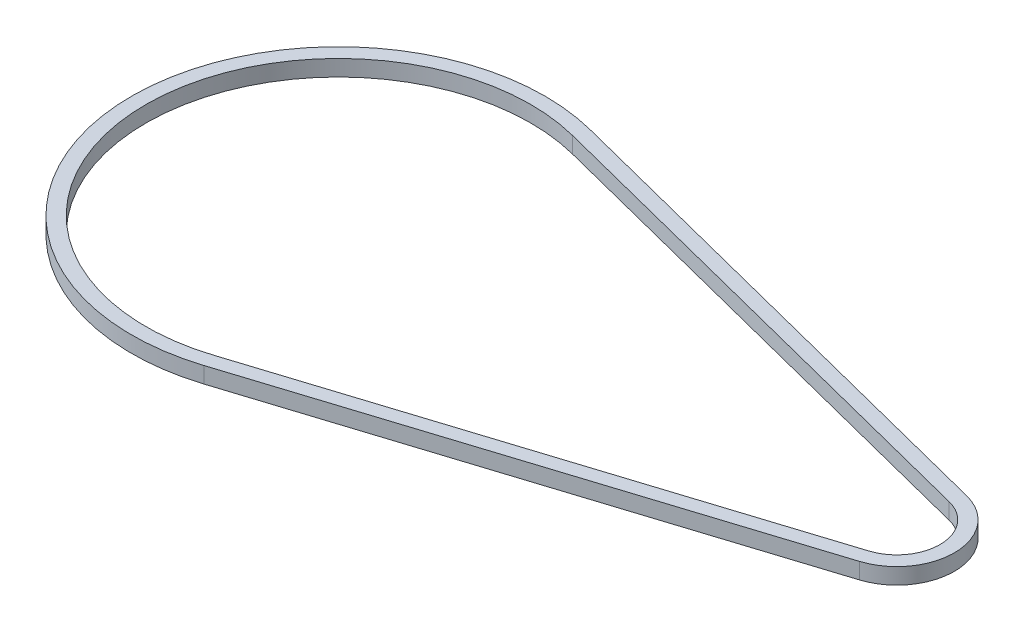
ISO-10303-21;
HEADER;
FILE_DESCRIPTION(('STEP AP214'),'2;1');
FILE_NAME('part.step','',(''),(''),'','','');
FILE_SCHEMA(('AUTOMOTIVE_DESIGN { 1 0 10303 214 1 1 1 1 }'));
ENDSEC;
DATA;
#1=APPLICATION_CONTEXT('core data for automotive mechanical design processes');
#2=APPLICATION_PROTOCOL_DEFINITION('international standard','automotive_design',2000,#1);
#3=PRODUCT_CONTEXT('',#1,'mechanical');
#4=PRODUCT('Part','Part','',(#3));
#5=PRODUCT_RELATED_PRODUCT_CATEGORY('part','',(#4));
#6=PRODUCT_DEFINITION_FORMATION('','',#4);
#7=PRODUCT_DEFINITION_CONTEXT('part definition',#1,'design');
#8=PRODUCT_DEFINITION('design','',#6,#7);
#9=PRODUCT_DEFINITION_SHAPE('','',#8);
#10=(LENGTH_UNIT() NAMED_UNIT(*) SI_UNIT(.MILLI.,.METRE.));
#11=(NAMED_UNIT(*) PLANE_ANGLE_UNIT() SI_UNIT($,.RADIAN.));
#12=(NAMED_UNIT(*) SI_UNIT($,.STERADIAN.) SOLID_ANGLE_UNIT());
#13=UNCERTAINTY_MEASURE_WITH_UNIT(LENGTH_MEASURE(1.E-05),#10,'distance_accuracy_value','');
#14=(GEOMETRIC_REPRESENTATION_CONTEXT(3) GLOBAL_UNCERTAINTY_ASSIGNED_CONTEXT((#13)) GLOBAL_UNIT_ASSIGNED_CONTEXT((#10,
#11,#12)) REPRESENTATION_CONTEXT('',''));
#15=CARTESIAN_POINT('',(0.,0.,0.));
#16=DIRECTION('',(0.,0.,1.));
#17=DIRECTION('',(1.,0.,0.));
#18=AXIS2_PLACEMENT_3D('',#15,#16,#17);
#19=CARTESIAN_POINT('',(-192.756134240439,8.4,3.24206526477096));
#20=DIRECTION('',(0.,1.,0.));
#21=DIRECTION('',(0.,0.,1.));
#22=AXIS2_PLACEMENT_3D('',#19,#20,#21);
#23=PLANE('',#22);
#24=CARTESIAN_POINT('',(-192.756134240439,8.4,3.24206526477096));
#25=DIRECTION('',(0.,1.,0.));
#26=DIRECTION('',(0.,0.,1.));
#27=AXIS2_PLACEMENT_3D('',#24,#25,#26);
#28=CIRCLE('',#27,108.);
#29=CARTESIAN_POINT('',(-166.082554013822,8.4,-101.412223313835));
#30=VERTEX_POINT('',#29);
#31=CARTESIAN_POINT('',(-160.036846225098,8.4,106.166543362885));
#32=VERTEX_POINT('',#31);
#33=EDGE_CURVE('E134',#30,#32,#28,.T.);
#34=ORIENTED_EDGE('',*,*,#33,.T.);
#35=DIRECTION('',(0.953004426834389,0.,-0.302956370512417));
#36=VECTOR('',#35,1.);
#37=CARTESIAN_POINT('',(-160.036846225098,8.4,106.166543362885));
#38=LINE('',#37,#36);
#39=CARTESIAN_POINT('',(99.7625568749338,8.4,23.5773318038965));
#40=VERTEX_POINT('',#39);
#41=EDGE_CURVE('E137',#32,#40,#38,.T.);
#42=ORIENTED_EDGE('',*,*,#41,.T.);
#43=CARTESIAN_POINT('',(90.6738657595612,8.4,-5.01280100113516));
#44=DIRECTION('',(0.,1.,0.));
#45=DIRECTION('',(0.,0.,1.));
#46=AXIS2_PLACEMENT_3D('',#43,#44,#45);
#47=CIRCLE('',#46,30.);
#48=CARTESIAN_POINT('',(98.0831936002882,8.4,-34.0834367174147));
#49=VERTEX_POINT('',#48);
#50=EDGE_CURVE('E140',#40,#49,#47,.T.);
#51=ORIENTED_EDGE('',*,*,#50,.T.);
#52=DIRECTION('',(-0.969021190542652,0.,-0.246977594690898));
#53=VECTOR('',#52,1.);
#54=CARTESIAN_POINT('',(-166.082554013822,8.4,-101.412223313835));
#55=LINE('',#54,#53);
#56=EDGE_CURVE('E142',#49,#30,#55,.T.);
#57=ORIENTED_EDGE('',*,*,#56,.T.);
#58=EDGE_LOOP('',(#34,#42,#51,#57));
#59=FACE_BOUND('',#58,.T.);
#60=DIRECTION('',(0.953004426834389,0.,-0.302956370512417));
#61=VECTOR('',#60,1.);
#62=CARTESIAN_POINT('',(-162.309019003941,8.4,99.0190101616271));
#63=LINE('',#62,#61);
#64=CARTESIAN_POINT('',(-162.309019003941,8.4,99.0190101616271));
#65=VERTEX_POINT('',#64);
#66=CARTESIAN_POINT('',(97.4903840960906,8.4,16.4297986026386));
#67=VERTEX_POINT('',#66);
#68=EDGE_CURVE('E106',#65,#67,#63,.T.);
#69=ORIENTED_EDGE('',*,*,#68,.F.);
#70=CARTESIAN_POINT('',(-192.756134240439,8.4,3.24206526477096));
#71=DIRECTION('',(0.,1.,0.));
#72=DIRECTION('',(0.,0.,1.));
#73=AXIS2_PLACEMENT_3D('',#70,#71,#72);
#74=CIRCLE('',#73,100.5);
#75=CARTESIAN_POINT('',(-167.934885974004,8.4,-94.1445643847655));
#76=VERTEX_POINT('',#75);
#77=EDGE_CURVE('E98',#76,#65,#74,.T.);
#78=ORIENTED_EDGE('',*,*,#77,.F.);
#79=DIRECTION('',(-0.969021190542652,0.,-0.246977594690898));
#80=VECTOR('',#79,1.);
#81=CARTESIAN_POINT('',(-167.934885974004,8.4,-94.1445643847655));
#82=LINE('',#81,#80);
#83=CARTESIAN_POINT('',(96.2308616401064,8.4,-26.8157777883448));
#84=VERTEX_POINT('',#83);
#85=EDGE_CURVE('E120',#84,#76,#82,.T.);
#86=ORIENTED_EDGE('',*,*,#85,.F.);
#87=CARTESIAN_POINT('',(90.6738657595612,8.4,-5.01280100113516));
#88=DIRECTION('',(0.,1.,0.));
#89=DIRECTION('',(0.,0.,1.));
#90=AXIS2_PLACEMENT_3D('',#87,#88,#89);
#91=CIRCLE('',#90,22.5);
#92=EDGE_CURVE('E118',#67,#84,#91,.T.);
#93=ORIENTED_EDGE('',*,*,#92,.F.);
#94=EDGE_LOOP('',(#69,#78,#86,#93));
#95=FACE_BOUND('',#94,.T.);
#96=ADVANCED_FACE('F33',(#59,#95),#23,.T.);
#97=CARTESIAN_POINT('',(-192.756134240439,0.,3.24206526477096));
#98=DIRECTION('',(0.,1.,0.));
#99=DIRECTION('',(0.,0.,1.));
#100=AXIS2_PLACEMENT_3D('',#97,#98,#99);
#101=PLANE('',#100);
#102=CARTESIAN_POINT('',(-192.756134240439,0.,3.24206526477096));
#103=DIRECTION('',(0.,1.,0.));
#104=DIRECTION('',(0.,0.,1.));
#105=AXIS2_PLACEMENT_3D('',#102,#103,#104);
#106=CIRCLE('',#105,108.);
#107=CARTESIAN_POINT('',(-166.082554013822,0.,-101.412223313835));
#108=VERTEX_POINT('',#107);
#109=CARTESIAN_POINT('',(-160.036846225098,0.,106.166543362885));
#110=VERTEX_POINT('',#109);
#111=EDGE_CURVE('E114',#108,#110,#106,.T.);
#112=ORIENTED_EDGE('',*,*,#111,.F.);
#113=DIRECTION('',(-0.969021190542652,0.,-0.246977594690898));
#114=VECTOR('',#113,1.);
#115=CARTESIAN_POINT('',(-166.082554013822,0.,-101.412223313835));
#116=LINE('',#115,#114);
#117=CARTESIAN_POINT('',(98.0831936002882,0.,-34.0834367174147));
#118=VERTEX_POINT('',#117);
#119=EDGE_CURVE('E138',#118,#108,#116,.T.);
#120=ORIENTED_EDGE('',*,*,#119,.F.);
#121=CARTESIAN_POINT('',(90.6738657595612,0.,-5.01280100113516));
#122=DIRECTION('',(0.,1.,0.));
#123=DIRECTION('',(0.,0.,1.));
#124=AXIS2_PLACEMENT_3D('',#121,#122,#123);
#125=CIRCLE('',#124,30.);
#126=CARTESIAN_POINT('',(99.7625568749338,0.,23.5773318038965));
#127=VERTEX_POINT('',#126);
#128=EDGE_CURVE('E149',#127,#118,#125,.T.);
#129=ORIENTED_EDGE('',*,*,#128,.F.);
#130=DIRECTION('',(0.953004426834389,0.,-0.302956370512417));
#131=VECTOR('',#130,1.);
#132=CARTESIAN_POINT('',(-160.036846225098,0.,106.166543362885));
#133=LINE('',#132,#131);
#134=EDGE_CURVE('E147',#110,#127,#133,.T.);
#135=ORIENTED_EDGE('',*,*,#134,.F.);
#136=EDGE_LOOP('',(#112,#120,#129,#135));
#137=FACE_BOUND('',#136,.T.);
#138=CARTESIAN_POINT('',(-192.756134240439,0.,3.24206526477096));
#139=DIRECTION('',(0.,1.,0.));
#140=DIRECTION('',(0.,0.,1.));
#141=AXIS2_PLACEMENT_3D('',#138,#139,#140);
#142=CIRCLE('',#141,100.5);
#143=CARTESIAN_POINT('',(-167.934885974004,0.,-94.1445643847656));
#144=VERTEX_POINT('',#143);
#145=CARTESIAN_POINT('',(-162.309019003941,0.,99.0190101616271));
#146=VERTEX_POINT('',#145);
#147=EDGE_CURVE('E56',#144,#146,#142,.T.);
#148=ORIENTED_EDGE('',*,*,#147,.T.);
#149=DIRECTION('',(0.953004426834389,0.,-0.302956370512417));
#150=VECTOR('',#149,1.);
#151=CARTESIAN_POINT('',(-162.309019003941,0.,99.0190101616271));
#152=LINE('',#151,#150);
#153=CARTESIAN_POINT('',(97.4903840960906,0.,16.4297986026386));
#154=VERTEX_POINT('',#153);
#155=EDGE_CURVE('E113',#146,#154,#152,.T.);
#156=ORIENTED_EDGE('',*,*,#155,.T.);
#157=CARTESIAN_POINT('',(90.6738657595612,0.,-5.01280100113516));
#158=DIRECTION('',(0.,1.,0.));
#159=DIRECTION('',(0.,0.,1.));
#160=AXIS2_PLACEMENT_3D('',#157,#158,#159);
#161=CIRCLE('',#160,22.5);
#162=CARTESIAN_POINT('',(96.2308616401065,0.,-26.8157777883448));
#163=VERTEX_POINT('',#162);
#164=EDGE_CURVE('E126',#154,#163,#161,.T.);
#165=ORIENTED_EDGE('',*,*,#164,.T.);
#166=DIRECTION('',(-0.969021190542652,0.,-0.246977594690898));
#167=VECTOR('',#166,1.);
#168=CARTESIAN_POINT('',(-167.934885974004,0.,-94.1445643847655));
#169=LINE('',#168,#167);
#170=EDGE_CURVE('E107',#163,#144,#169,.T.);
#171=ORIENTED_EDGE('',*,*,#170,.T.);
#172=EDGE_LOOP('',(#148,#156,#165,#171));
#173=FACE_BOUND('',#172,.T.);
#174=ADVANCED_FACE('F167',(#137,#173),#101,.F.);
#175=CARTESIAN_POINT('',(-192.756134240439,8.4,3.24206526477096));
#176=DIRECTION('',(0.,-1.,0.));
#177=DIRECTION('',(0.,0.,-1.));
#178=AXIS2_PLACEMENT_3D('',#175,#176,#177);
#179=CYLINDRICAL_SURFACE('',#178,108.);
#180=ORIENTED_EDGE('',*,*,#111,.T.);
#181=DIRECTION('',(0.,-1.,0.));
#182=VECTOR('',#181,1.);
#183=CARTESIAN_POINT('',(-160.036846225098,8.4,106.166543362885));
#184=LINE('',#183,#182);
#185=EDGE_CURVE('E11',#32,#110,#184,.T.);
#186=ORIENTED_EDGE('',*,*,#185,.F.);
#187=ORIENTED_EDGE('',*,*,#33,.F.);
#188=DIRECTION('',(0.,-1.,0.));
#189=VECTOR('',#188,1.);
#190=CARTESIAN_POINT('',(-166.082554013822,8.4,-101.412223313835));
#191=LINE('',#190,#189);
#192=EDGE_CURVE('E144',#30,#108,#191,.T.);
#193=ORIENTED_EDGE('',*,*,#192,.T.);
#194=EDGE_LOOP('',(#180,#186,#187,#193));
#195=FACE_BOUND('',#194,.T.);
#196=ADVANCED_FACE('F35',(#195),#179,.T.);
#197=CARTESIAN_POINT('',(-160.036846225098,8.4,106.166543362885));
#198=DIRECTION('',(-0.302956370512418,0.,-0.953004426834389));
#199=DIRECTION('',(-0.953004426834389,0.,0.302956370512418));
#200=AXIS2_PLACEMENT_3D('',#197,#198,#199);
#201=PLANE('',#200);
#202=ORIENTED_EDGE('',*,*,#134,.T.);
#203=DIRECTION('',(0.,-1.,0.));
#204=VECTOR('',#203,1.);
#205=CARTESIAN_POINT('',(99.7625568749338,8.4,23.5773318038965));
#206=LINE('',#205,#204);
#207=EDGE_CURVE('E41',#40,#127,#206,.T.);
#208=ORIENTED_EDGE('',*,*,#207,.F.);
#209=ORIENTED_EDGE('',*,*,#41,.F.);
#210=ORIENTED_EDGE('',*,*,#185,.T.);
#211=EDGE_LOOP('',(#202,#208,#209,#210));
#212=FACE_BOUND('',#211,.T.);
#213=ADVANCED_FACE('F177',(#212),#201,.F.);
#214=CARTESIAN_POINT('',(90.6738657595612,8.4,-5.01280100113516));
#215=DIRECTION('',(0.,-1.,0.));
#216=DIRECTION('',(0.,0.,-1.));
#217=AXIS2_PLACEMENT_3D('',#214,#215,#216);
#218=CYLINDRICAL_SURFACE('',#217,30.);
#219=ORIENTED_EDGE('',*,*,#128,.T.);
#220=DIRECTION('',(0.,-1.,0.));
#221=VECTOR('',#220,1.);
#222=CARTESIAN_POINT('',(98.0831936002882,8.4,-34.0834367174147));
#223=LINE('',#222,#221);
#224=EDGE_CURVE('E154',#49,#118,#223,.T.);
#225=ORIENTED_EDGE('',*,*,#224,.F.);
#226=ORIENTED_EDGE('',*,*,#50,.F.);
#227=ORIENTED_EDGE('',*,*,#207,.T.);
#228=EDGE_LOOP('',(#219,#225,#226,#227));
#229=FACE_BOUND('',#228,.T.);
#230=ADVANCED_FACE('F161',(#229),#218,.T.);
#231=CARTESIAN_POINT('',(-166.082554013822,8.4,-101.412223313835));
#232=DIRECTION('',(-0.246977594690898,0.,0.969021190542652));
#233=DIRECTION('',(0.969021190542652,0.,0.246977594690898));
#234=AXIS2_PLACEMENT_3D('',#231,#232,#233);
#235=PLANE('',#234);
#236=ORIENTED_EDGE('',*,*,#119,.T.);
#237=ORIENTED_EDGE('',*,*,#192,.F.);
#238=ORIENTED_EDGE('',*,*,#56,.F.);
#239=ORIENTED_EDGE('',*,*,#224,.T.);
#240=EDGE_LOOP('',(#236,#237,#238,#239));
#241=FACE_BOUND('',#240,.T.);
#242=ADVANCED_FACE('F171',(#241),#235,.F.);
#243=CARTESIAN_POINT('',(-192.756134240439,8.4,3.24206526477096));
#244=DIRECTION('',(0.,-1.,0.));
#245=DIRECTION('',(0.,0.,-1.));
#246=AXIS2_PLACEMENT_3D('',#243,#244,#245);
#247=CYLINDRICAL_SURFACE('',#246,100.5);
#248=ORIENTED_EDGE('',*,*,#147,.F.);
#249=DIRECTION('',(0.,-1.,0.));
#250=VECTOR('',#249,1.);
#251=CARTESIAN_POINT('',(-167.934885974004,8.4,-94.1445643847655));
#252=LINE('',#251,#250);
#253=EDGE_CURVE('E102',#76,#144,#252,.T.);
#254=ORIENTED_EDGE('',*,*,#253,.F.);
#255=ORIENTED_EDGE('',*,*,#77,.T.);
#256=DIRECTION('',(0.,-1.,0.));
#257=VECTOR('',#256,1.);
#258=CARTESIAN_POINT('',(-162.309019003941,8.4,99.0190101616271));
#259=LINE('',#258,#257);
#260=EDGE_CURVE('E101',#65,#146,#259,.T.);
#261=ORIENTED_EDGE('',*,*,#260,.T.);
#262=EDGE_LOOP('',(#248,#254,#255,#261));
#263=FACE_BOUND('',#262,.T.);
#264=ADVANCED_FACE('F100',(#263),#247,.F.);
#265=CARTESIAN_POINT('',(-162.309019003941,8.4,99.0190101616271));
#266=DIRECTION('',(-0.302956370512417,0.,-0.953004426834389));
#267=DIRECTION('',(-0.953004426834389,0.,0.302956370512417));
#268=AXIS2_PLACEMENT_3D('',#265,#266,#267);
#269=PLANE('',#268);
#270=ORIENTED_EDGE('',*,*,#155,.F.);
#271=ORIENTED_EDGE('',*,*,#260,.F.);
#272=ORIENTED_EDGE('',*,*,#68,.T.);
#273=DIRECTION('',(0.,-1.,0.));
#274=VECTOR('',#273,1.);
#275=CARTESIAN_POINT('',(97.4903840960906,8.4,16.4297986026386));
#276=LINE('',#275,#274);
#277=EDGE_CURVE('E115',#67,#154,#276,.T.);
#278=ORIENTED_EDGE('',*,*,#277,.T.);
#279=EDGE_LOOP('',(#270,#271,#272,#278));
#280=FACE_BOUND('',#279,.T.);
#281=ADVANCED_FACE('F110',(#280),#269,.T.);
#282=CARTESIAN_POINT('',(90.6738657595612,8.4,-5.01280100113516));
#283=DIRECTION('',(0.,-1.,0.));
#284=DIRECTION('',(0.,0.,-1.));
#285=AXIS2_PLACEMENT_3D('',#282,#283,#284);
#286=CYLINDRICAL_SURFACE('',#285,22.5);
#287=ORIENTED_EDGE('',*,*,#164,.F.);
#288=ORIENTED_EDGE('',*,*,#277,.F.);
#289=ORIENTED_EDGE('',*,*,#92,.T.);
#290=DIRECTION('',(0.,-1.,0.));
#291=VECTOR('',#290,1.);
#292=CARTESIAN_POINT('',(96.2308616401065,8.4,-26.8157777883448));
#293=LINE('',#292,#291);
#294=EDGE_CURVE('E48',#84,#163,#293,.T.);
#295=ORIENTED_EDGE('',*,*,#294,.T.);
#296=EDGE_LOOP('',(#287,#288,#289,#295));
#297=FACE_BOUND('',#296,.T.);
#298=ADVANCED_FACE('F200',(#297),#286,.F.);
#299=CARTESIAN_POINT('',(-167.934885974004,8.4,-94.1445643847655));
#300=DIRECTION('',(-0.246977594690898,0.,0.969021190542652));
#301=DIRECTION('',(0.969021190542652,0.,0.246977594690898));
#302=AXIS2_PLACEMENT_3D('',#299,#300,#301);
#303=PLANE('',#302);
#304=ORIENTED_EDGE('',*,*,#170,.F.);
#305=ORIENTED_EDGE('',*,*,#294,.F.);
#306=ORIENTED_EDGE('',*,*,#85,.T.);
#307=ORIENTED_EDGE('',*,*,#253,.T.);
#308=EDGE_LOOP('',(#304,#305,#306,#307));
#309=FACE_BOUND('',#308,.T.);
#310=ADVANCED_FACE('F204',(#309),#303,.T.);
#311=CLOSED_SHELL('',(#96,#174,#196,#213,#230,#242,#264,#281,#298,#310));
#312=MANIFOLD_SOLID_BREP('B2',#311);
#313=ADVANCED_BREP_SHAPE_REPRESENTATION('',(#18,#312),#14);
#314=SHAPE_DEFINITION_REPRESENTATION(#9,#313);
ENDSEC;
END-ISO-10303-21;
